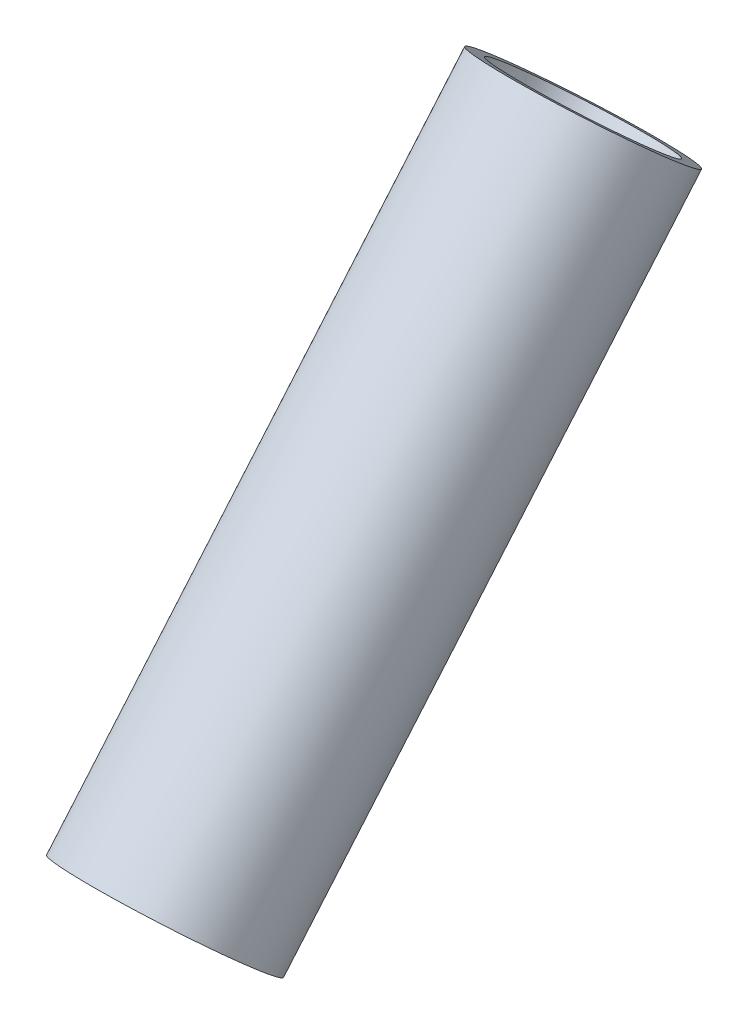
ISO-10303-21;
HEADER;
FILE_DESCRIPTION(('STEP AP214'),'2;1');
FILE_NAME('part.step','',(''),(''),'','','');
FILE_SCHEMA(('AUTOMOTIVE_DESIGN { 1 0 10303 214 1 1 1 1 }'));
ENDSEC;
DATA;
#1=APPLICATION_CONTEXT('core data for automotive mechanical design processes');
#2=APPLICATION_PROTOCOL_DEFINITION('international standard','automotive_design',2000,#1);
#3=PRODUCT_CONTEXT('',#1,'mechanical');
#4=PRODUCT('Part','Part','',(#3));
#5=PRODUCT_RELATED_PRODUCT_CATEGORY('part','',(#4));
#6=PRODUCT_DEFINITION_FORMATION('','',#4);
#7=PRODUCT_DEFINITION_CONTEXT('part definition',#1,'design');
#8=PRODUCT_DEFINITION('design','',#6,#7);
#9=PRODUCT_DEFINITION_SHAPE('','',#8);
#10=(LENGTH_UNIT() NAMED_UNIT(*) SI_UNIT(.MILLI.,.METRE.));
#11=(NAMED_UNIT(*) PLANE_ANGLE_UNIT() SI_UNIT($,.RADIAN.));
#12=(NAMED_UNIT(*) SI_UNIT($,.STERADIAN.) SOLID_ANGLE_UNIT());
#13=UNCERTAINTY_MEASURE_WITH_UNIT(LENGTH_MEASURE(1.E-05),#10,'distance_accuracy_value','');
#14=(GEOMETRIC_REPRESENTATION_CONTEXT(3) GLOBAL_UNCERTAINTY_ASSIGNED_CONTEXT((#13)) GLOBAL_UNIT_ASSIGNED_CONTEXT((#10,
#11,#12)) REPRESENTATION_CONTEXT('',''));
#15=CARTESIAN_POINT('',(0.,0.,0.));
#16=DIRECTION('',(0.,0.,1.));
#17=DIRECTION('',(1.,0.,0.));
#18=AXIS2_PLACEMENT_3D('',#15,#16,#17);
#19=CARTESIAN_POINT('',(0.,1.47451495458029E-12,353.553390593276));
#20=DIRECTION('',(0.,-0.76140894996316,0.648271864973329));
#21=DIRECTION('',(0.,-0.648271864973329,-0.76140894996316));
#22=AXIS2_PLACEMENT_3D('',#19,#20,#21);
#23=CYLINDRICAL_SURFACE('',#22,5.99999999999891);
#24=CARTESIAN_POINT('',(0.,6.85268054966982,347.718943808516));
#25=DIRECTION('',(0.,-0.76140894996316,0.648271864973329));
#26=DIRECTION('',(0.,-0.648271864973329,-0.76140894996316));
#27=AXIS2_PLACEMENT_3D('',#24,#25,#26);
#28=CIRCLE('',#27,5.99999999999904);
#29=CARTESIAN_POINT('',(0.,2.96304935983047,343.150490108738));
#30=VERTEX_POINT('',#29);
#31=EDGE_CURVE('E10',#30,#30,#28,.T.);
#32=ORIENTED_EDGE('',*,*,#31,.F.);
#33=EDGE_LOOP('',(#32));
#34=FACE_BOUND('',#33,.T.);
#35=CARTESIAN_POINT('',(0.,38.0704474981594,321.13979734461));
#36=DIRECTION('',(0.,-0.76140894996316,0.648271864973329));
#37=DIRECTION('',(0.,-0.648271864973329,-0.76140894996316));
#38=AXIS2_PLACEMENT_3D('',#35,#36,#37);
#39=CIRCLE('',#38,5.99999999999881);
#40=CARTESIAN_POINT('',(0.,34.1808163083202,316.571343644832));
#41=VERTEX_POINT('',#40);
#42=EDGE_CURVE('E45',#41,#41,#39,.T.);
#43=ORIENTED_EDGE('',*,*,#42,.T.);
#44=EDGE_LOOP('',(#43));
#45=FACE_BOUND('',#44,.T.);
#46=ADVANCED_FACE('F31',(#34,#45),#23,.T.);
#47=CARTESIAN_POINT('',(0.,10.7423117395092,352.287397508295));
#48=DIRECTION('',(0.,0.76140894996316,-0.648271864973329));
#49=DIRECTION('',(0.,0.648271864973329,0.76140894996316));
#50=AXIS2_PLACEMENT_3D('',#47,#48,#49);
#51=PLANE('',#50);
#52=CARTESIAN_POINT('',(0.,6.85268054966981,347.718943808516));
#53=DIRECTION('',(0.,-0.76140894996316,0.648271864973329));
#54=DIRECTION('',(0.,-0.648271864973329,-0.76140894996316));
#55=AXIS2_PLACEMENT_3D('',#52,#53,#54);
#56=CIRCLE('',#55,4.99999999999848);
#57=CARTESIAN_POINT('',(0.,3.61132122480415,343.911899058702));
#58=VERTEX_POINT('',#57);
#59=EDGE_CURVE('E37',#58,#58,#56,.T.);
#60=ORIENTED_EDGE('',*,*,#59,.F.);
#61=EDGE_LOOP('',(#60));
#62=FACE_BOUND('',#61,.T.);
#63=ORIENTED_EDGE('',*,*,#31,.T.);
#64=EDGE_LOOP('',(#63));
#65=FACE_BOUND('',#64,.T.);
#66=ADVANCED_FACE('F60',(#62,#65),#51,.F.);
#67=CARTESIAN_POINT('',(0.,1.47451495458029E-12,353.553390593276));
#68=DIRECTION('',(0.,-0.76140894996316,0.648271864973329));
#69=DIRECTION('',(0.,-0.648271864973329,-0.76140894996316));
#70=AXIS2_PLACEMENT_3D('',#67,#68,#69);
#71=CYLINDRICAL_SURFACE('',#70,4.99999999999862);
#72=CARTESIAN_POINT('',(0.,38.0704474981594,321.13979734461));
#73=DIRECTION('',(0.,-0.76140894996316,0.648271864973329));
#74=DIRECTION('',(0.,-0.648271864973329,-0.76140894996316));
#75=AXIS2_PLACEMENT_3D('',#72,#73,#74);
#76=CIRCLE('',#75,4.99999999999877);
#77=CARTESIAN_POINT('',(0.,34.8290881732935,317.332752594795));
#78=VERTEX_POINT('',#77);
#79=EDGE_CURVE('E41',#78,#78,#76,.T.);
#80=ORIENTED_EDGE('',*,*,#79,.F.);
#81=EDGE_LOOP('',(#80));
#82=FACE_BOUND('',#81,.T.);
#83=ORIENTED_EDGE('',*,*,#59,.T.);
#84=EDGE_LOOP('',(#83));
#85=FACE_BOUND('',#84,.T.);
#86=ADVANCED_FACE('F55',(#82,#85),#71,.F.);
#87=CARTESIAN_POINT('',(0.,41.9600786879986,325.708251044388));
#88=DIRECTION('',(0.,-0.76140894996316,0.648271864973329));
#89=DIRECTION('',(0.,-0.648271864973329,-0.76140894996316));
#90=AXIS2_PLACEMENT_3D('',#87,#88,#89);
#91=PLANE('',#90);
#92=ORIENTED_EDGE('',*,*,#42,.F.);
#93=EDGE_LOOP('',(#92));
#94=FACE_BOUND('',#93,.T.);
#95=ORIENTED_EDGE('',*,*,#79,.T.);
#96=EDGE_LOOP('',(#95));
#97=FACE_BOUND('',#96,.T.);
#98=ADVANCED_FACE('F52',(#94,#97),#91,.F.);
#99=CLOSED_SHELL('',(#46,#66,#86,#98));
#100=MANIFOLD_SOLID_BREP('B2',#99);
#101=ADVANCED_BREP_SHAPE_REPRESENTATION('',(#18,#100),#14);
#102=SHAPE_DEFINITION_REPRESENTATION(#9,#101);
ENDSEC;
END-ISO-10303-21;
